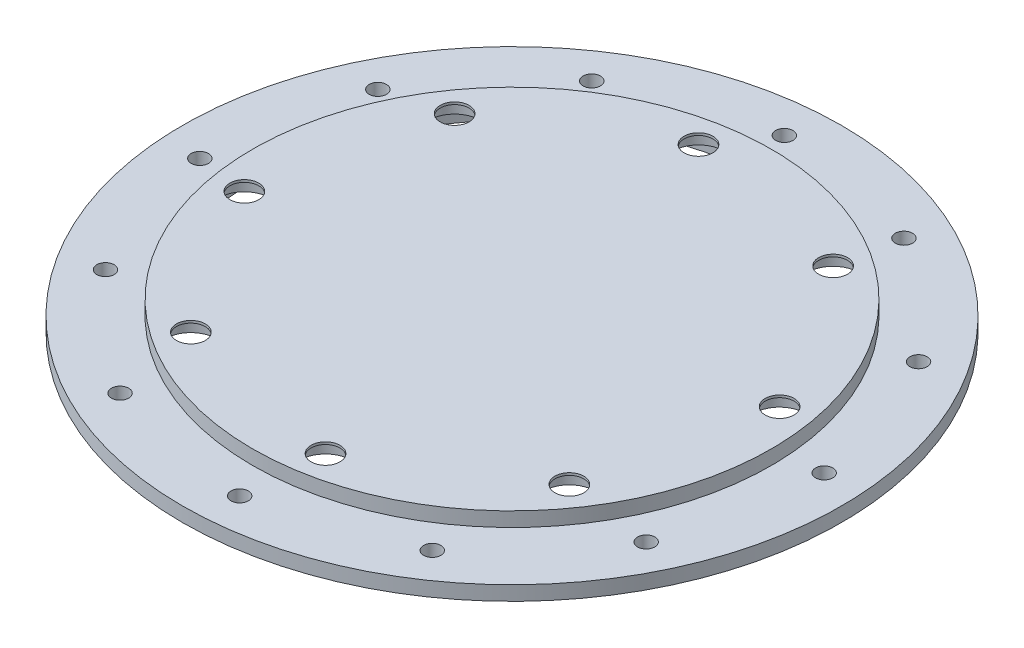
ISO-10303-21;
HEADER;
FILE_DESCRIPTION(('STEP AP214'),'2;1');
FILE_NAME('part.step','',(''),(''),'','','');
FILE_SCHEMA(('AUTOMOTIVE_DESIGN { 1 0 10303 214 1 1 1 1 }'));
ENDSEC;
DATA;
#1=APPLICATION_CONTEXT('core data for automotive mechanical design processes');
#2=APPLICATION_PROTOCOL_DEFINITION('international standard','automotive_design',2000,#1);
#3=PRODUCT_CONTEXT('',#1,'mechanical');
#4=PRODUCT('Part','Part','',(#3));
#5=PRODUCT_RELATED_PRODUCT_CATEGORY('part','',(#4));
#6=PRODUCT_DEFINITION_FORMATION('','',#4);
#7=PRODUCT_DEFINITION_CONTEXT('part definition',#1,'design');
#8=PRODUCT_DEFINITION('design','',#6,#7);
#9=PRODUCT_DEFINITION_SHAPE('','',#8);
#10=(LENGTH_UNIT() NAMED_UNIT(*) SI_UNIT(.MILLI.,.METRE.));
#11=(NAMED_UNIT(*) PLANE_ANGLE_UNIT() SI_UNIT($,.RADIAN.));
#12=(NAMED_UNIT(*) SI_UNIT($,.STERADIAN.) SOLID_ANGLE_UNIT());
#13=UNCERTAINTY_MEASURE_WITH_UNIT(LENGTH_MEASURE(1.E-05),#10,'distance_accuracy_value','');
#14=(GEOMETRIC_REPRESENTATION_CONTEXT(3) GLOBAL_UNCERTAINTY_ASSIGNED_CONTEXT((#13)) GLOBAL_UNIT_ASSIGNED_CONTEXT((#10,
#11,#12)) REPRESENTATION_CONTEXT('',''));
#15=CARTESIAN_POINT('',(0.,0.,0.));
#16=DIRECTION('',(0.,0.,1.));
#17=DIRECTION('',(1.,0.,0.));
#18=AXIS2_PLACEMENT_3D('',#15,#16,#17);
#19=CARTESIAN_POINT('',(0.,5.,0.));
#20=DIRECTION('',(0.,-1.,0.));
#21=DIRECTION('',(0.,0.,-1.));
#22=AXIS2_PLACEMENT_3D('',#19,#20,#21);
#23=CYLINDRICAL_SURFACE('',#22,114.3);
#24=CARTESIAN_POINT('',(0.,5.,0.));
#25=DIRECTION('',(0.,1.,0.));
#26=DIRECTION('',(0.,0.,1.));
#27=AXIS2_PLACEMENT_3D('',#24,#25,#26);
#28=CIRCLE('',#27,114.3);
#29=CARTESIAN_POINT('',(0.,5.,114.3));
#30=VERTEX_POINT('',#29);
#31=EDGE_CURVE('E49',#30,#30,#28,.T.);
#32=ORIENTED_EDGE('',*,*,#31,.F.);
#33=EDGE_LOOP('',(#32));
#34=FACE_BOUND('',#33,.T.);
#35=CARTESIAN_POINT('',(0.,0.,0.));
#36=DIRECTION('',(0.,1.,0.));
#37=DIRECTION('',(0.,0.,1.));
#38=AXIS2_PLACEMENT_3D('',#35,#36,#37);
#39=CIRCLE('',#38,114.3);
#40=CARTESIAN_POINT('',(0.,0.,114.3));
#41=VERTEX_POINT('',#40);
#42=EDGE_CURVE('E44',#41,#41,#39,.T.);
#43=ORIENTED_EDGE('',*,*,#42,.T.);
#44=EDGE_LOOP('',(#43));
#45=FACE_BOUND('',#44,.T.);
#46=ADVANCED_FACE('F41',(#34,#45),#23,.T.);
#47=CARTESIAN_POINT('',(0.,5.,0.));
#48=DIRECTION('',(0.,1.,0.));
#49=DIRECTION('',(0.,0.,1.));
#50=AXIS2_PLACEMENT_3D('',#47,#48,#49);
#51=PLANE('',#50);
#52=CARTESIAN_POINT('',(44.6970334047992,5.,-91.2399868742333));
#53=DIRECTION('',(0.,1.,0.));
#54=DIRECTION('',(0.,0.,1.));
#55=AXIS2_PLACEMENT_3D('',#52,#53,#54);
#56=CIRCLE('',#55,3.);
#57=CARTESIAN_POINT('',(44.6970334047992,5.,-88.2399868742333));
#58=VERTEX_POINT('',#57);
#59=EDGE_CURVE('E160',#58,#58,#56,.T.);
#60=ORIENTED_EDGE('',*,*,#59,.F.);
#61=EDGE_LOOP('',(#60));
#62=FACE_BOUND('',#61,.T.);
#63=CARTESIAN_POINT('',(84.3287598394745,5.,-56.6676297716451));
#64=DIRECTION('',(0.,1.,0.));
#65=DIRECTION('',(0.,0.,1.));
#66=AXIS2_PLACEMENT_3D('',#63,#64,#65);
#67=CIRCLE('',#66,3.);
#68=CARTESIAN_POINT('',(84.3287598394745,5.,-53.667629771645));
#69=VERTEX_POINT('',#68);
#70=EDGE_CURVE('E152',#69,#69,#67,.T.);
#71=ORIENTED_EDGE('',*,*,#70,.F.);
#72=EDGE_LOOP('',(#71));
#73=FACE_BOUND('',#72,.T.);
#74=CARTESIAN_POINT('',(101.364663176444,5.,-6.91122703475861));
#75=DIRECTION('',(0.,1.,0.));
#76=DIRECTION('',(0.,0.,1.));
#77=AXIS2_PLACEMENT_3D('',#74,#75,#76);
#78=CIRCLE('',#77,3.);
#79=CARTESIAN_POINT('',(101.364663176444,5.,-3.91122703475861));
#80=VERTEX_POINT('',#79);
#81=EDGE_CURVE('E144',#80,#80,#78,.T.);
#82=ORIENTED_EDGE('',*,*,#81,.F.);
#83=EDGE_LOOP('',(#82));
#84=FACE_BOUND('',#83,.T.);
#85=CARTESIAN_POINT('',(91.2399868742331,5.,44.6970334047995));
#86=DIRECTION('',(0.,1.,0.));
#87=DIRECTION('',(0.,0.,1.));
#88=AXIS2_PLACEMENT_3D('',#85,#86,#87);
#89=CIRCLE('',#88,3.);
#90=CARTESIAN_POINT('',(91.2399868742331,5.,47.6970334047995));
#91=VERTEX_POINT('',#90);
#92=EDGE_CURVE('E136',#91,#91,#89,.T.);
#93=ORIENTED_EDGE('',*,*,#92,.F.);
#94=EDGE_LOOP('',(#93));
#95=FACE_BOUND('',#94,.T.);
#96=CARTESIAN_POINT('',(56.6676297716448,5.,84.3287598394747));
#97=DIRECTION('',(0.,1.,0.));
#98=DIRECTION('',(0.,0.,1.));
#99=AXIS2_PLACEMENT_3D('',#96,#97,#98);
#100=CIRCLE('',#99,3.);
#101=CARTESIAN_POINT('',(56.6676297716448,5.,87.3287598394747));
#102=VERTEX_POINT('',#101);
#103=EDGE_CURVE('E128',#102,#102,#100,.T.);
#104=ORIENTED_EDGE('',*,*,#103,.F.);
#105=EDGE_LOOP('',(#104));
#106=FACE_BOUND('',#105,.T.);
#107=CARTESIAN_POINT('',(6.91122703475755,5.,101.364663176444));
#108=DIRECTION('',(0.,1.,0.));
#109=DIRECTION('',(0.,0.,1.));
#110=AXIS2_PLACEMENT_3D('',#107,#108,#109);
#111=CIRCLE('',#110,3.);
#112=CARTESIAN_POINT('',(6.91122703475755,5.,104.364663176444));
#113=VERTEX_POINT('',#112);
#114=EDGE_CURVE('E120',#113,#113,#111,.T.);
#115=ORIENTED_EDGE('',*,*,#114,.F.);
#116=EDGE_LOOP('',(#115));
#117=FACE_BOUND('',#116,.T.);
#118=CARTESIAN_POINT('',(-44.6970334047999,5.,91.239986874233));
#119=DIRECTION('',(0.,1.,0.));
#120=DIRECTION('',(0.,0.,1.));
#121=AXIS2_PLACEMENT_3D('',#118,#119,#120);
#122=CIRCLE('',#121,3.);
#123=CARTESIAN_POINT('',(-44.6970334047999,5.,94.239986874233));
#124=VERTEX_POINT('',#123);
#125=EDGE_CURVE('E112',#124,#124,#122,.T.);
#126=ORIENTED_EDGE('',*,*,#125,.F.);
#127=EDGE_LOOP('',(#126));
#128=FACE_BOUND('',#127,.T.);
#129=CARTESIAN_POINT('',(-84.3287598394749,5.,56.6676297716445));
#130=DIRECTION('',(0.,1.,0.));
#131=DIRECTION('',(0.,0.,1.));
#132=AXIS2_PLACEMENT_3D('',#129,#130,#131);
#133=CIRCLE('',#132,3.);
#134=CARTESIAN_POINT('',(-84.3287598394749,5.,59.6676297716445));
#135=VERTEX_POINT('',#134);
#136=EDGE_CURVE('E104',#135,#135,#133,.T.);
#137=ORIENTED_EDGE('',*,*,#136,.F.);
#138=EDGE_LOOP('',(#137));
#139=FACE_BOUND('',#138,.T.);
#140=CARTESIAN_POINT('',(-101.364663176444,5.,6.91122703475791));
#141=DIRECTION('',(0.,1.,0.));
#142=DIRECTION('',(0.,0.,1.));
#143=AXIS2_PLACEMENT_3D('',#140,#141,#142);
#144=CIRCLE('',#143,3.);
#145=CARTESIAN_POINT('',(-101.364663176444,5.,9.91122703475791));
#146=VERTEX_POINT('',#145);
#147=EDGE_CURVE('E96',#146,#146,#144,.T.);
#148=ORIENTED_EDGE('',*,*,#147,.F.);
#149=EDGE_LOOP('',(#148));
#150=FACE_BOUND('',#149,.T.);
#151=CARTESIAN_POINT('',(-91.2399868742328,5.,-44.6970334048002));
#152=DIRECTION('',(0.,1.,0.));
#153=DIRECTION('',(0.,0.,1.));
#154=AXIS2_PLACEMENT_3D('',#151,#152,#153);
#155=CIRCLE('',#154,3.);
#156=CARTESIAN_POINT('',(-91.2399868742328,5.,-41.6970334048002));
#157=VERTEX_POINT('',#156);
#158=EDGE_CURVE('E88',#157,#157,#155,.T.);
#159=ORIENTED_EDGE('',*,*,#158,.F.);
#160=EDGE_LOOP('',(#159));
#161=FACE_BOUND('',#160,.T.);
#162=CARTESIAN_POINT('',(-56.6676297716442,5.,-84.3287598394751));
#163=DIRECTION('',(0.,1.,0.));
#164=DIRECTION('',(0.,0.,1.));
#165=AXIS2_PLACEMENT_3D('',#162,#163,#164);
#166=CIRCLE('',#165,3.);
#167=CARTESIAN_POINT('',(-56.6676297716442,5.,-81.3287598394751));
#168=VERTEX_POINT('',#167);
#169=EDGE_CURVE('E80',#168,#168,#166,.T.);
#170=ORIENTED_EDGE('',*,*,#169,.F.);
#171=EDGE_LOOP('',(#170));
#172=FACE_BOUND('',#171,.T.);
#173=CARTESIAN_POINT('',(-6.91122703475755,5.,-101.364663176444));
#174=DIRECTION('',(0.,1.,0.));
#175=DIRECTION('',(0.,0.,1.));
#176=AXIS2_PLACEMENT_3D('',#173,#174,#175);
#177=CIRCLE('',#176,3.);
#178=CARTESIAN_POINT('',(-6.91122703475755,5.,-98.3646631764445));
#179=VERTEX_POINT('',#178);
#180=EDGE_CURVE('E72',#179,#179,#177,.T.);
#181=ORIENTED_EDGE('',*,*,#180,.F.);
#182=EDGE_LOOP('',(#181));
#183=FACE_BOUND('',#182,.T.);
#184=CARTESIAN_POINT('',(0.,5.,0.));
#185=DIRECTION('',(0.,1.,0.));
#186=DIRECTION('',(0.,0.,1.));
#187=AXIS2_PLACEMENT_3D('',#184,#185,#186);
#188=CIRCLE('',#187,90.);
#189=CARTESIAN_POINT('',(0.,5.,90.));
#190=VERTEX_POINT('',#189);
#191=EDGE_CURVE('E10',#190,#190,#188,.T.);
#192=ORIENTED_EDGE('',*,*,#191,.F.);
#193=EDGE_LOOP('',(#192));
#194=FACE_BOUND('',#193,.T.);
#195=ORIENTED_EDGE('',*,*,#31,.T.);
#196=EDGE_LOOP('',(#195));
#197=FACE_BOUND('',#196,.T.);
#198=ADVANCED_FACE('F327',(#62,#73,#84,#95,#106,#117,#128,#139,#150,#161,#172,#183,#194,#197),
#51,.T.);
#199=CARTESIAN_POINT('',(0.,0.,0.));
#200=DIRECTION('',(0.,1.,0.));
#201=DIRECTION('',(0.,0.,1.));
#202=AXIS2_PLACEMENT_3D('',#199,#200,#201);
#203=PLANE('',#202);
#204=CARTESIAN_POINT('',(44.6970334047992,0.,-91.2399868742333));
#205=DIRECTION('',(0.,1.,0.));
#206=DIRECTION('',(0.,0.,1.));
#207=AXIS2_PLACEMENT_3D('',#204,#205,#206);
#208=CIRCLE('',#207,3.);
#209=CARTESIAN_POINT('',(44.6970334047992,0.,-88.2399868742333));
#210=VERTEX_POINT('',#209);
#211=EDGE_CURVE('E156',#210,#210,#208,.T.);
#212=ORIENTED_EDGE('',*,*,#211,.T.);
#213=EDGE_LOOP('',(#212));
#214=FACE_BOUND('',#213,.T.);
#215=CARTESIAN_POINT('',(84.3287598394745,0.,-56.6676297716451));
#216=DIRECTION('',(0.,1.,0.));
#217=DIRECTION('',(0.,0.,1.));
#218=AXIS2_PLACEMENT_3D('',#215,#216,#217);
#219=CIRCLE('',#218,3.);
#220=CARTESIAN_POINT('',(84.3287598394745,0.,-53.667629771645));
#221=VERTEX_POINT('',#220);
#222=EDGE_CURVE('E148',#221,#221,#219,.T.);
#223=ORIENTED_EDGE('',*,*,#222,.T.);
#224=EDGE_LOOP('',(#223));
#225=FACE_BOUND('',#224,.T.);
#226=CARTESIAN_POINT('',(101.364663176444,0.,-6.91122703475861));
#227=DIRECTION('',(0.,1.,0.));
#228=DIRECTION('',(0.,0.,1.));
#229=AXIS2_PLACEMENT_3D('',#226,#227,#228);
#230=CIRCLE('',#229,3.);
#231=CARTESIAN_POINT('',(101.364663176444,0.,-3.91122703475861));
#232=VERTEX_POINT('',#231);
#233=EDGE_CURVE('E140',#232,#232,#230,.T.);
#234=ORIENTED_EDGE('',*,*,#233,.T.);
#235=EDGE_LOOP('',(#234));
#236=FACE_BOUND('',#235,.T.);
#237=CARTESIAN_POINT('',(91.2399868742331,0.,44.6970334047995));
#238=DIRECTION('',(0.,1.,0.));
#239=DIRECTION('',(0.,0.,1.));
#240=AXIS2_PLACEMENT_3D('',#237,#238,#239);
#241=CIRCLE('',#240,3.);
#242=CARTESIAN_POINT('',(91.2399868742331,0.,47.6970334047995));
#243=VERTEX_POINT('',#242);
#244=EDGE_CURVE('E132',#243,#243,#241,.T.);
#245=ORIENTED_EDGE('',*,*,#244,.T.);
#246=EDGE_LOOP('',(#245));
#247=FACE_BOUND('',#246,.T.);
#248=CARTESIAN_POINT('',(56.6676297716448,0.,84.3287598394747));
#249=DIRECTION('',(0.,1.,0.));
#250=DIRECTION('',(0.,0.,1.));
#251=AXIS2_PLACEMENT_3D('',#248,#249,#250);
#252=CIRCLE('',#251,3.);
#253=CARTESIAN_POINT('',(56.6676297716448,0.,87.3287598394747));
#254=VERTEX_POINT('',#253);
#255=EDGE_CURVE('E124',#254,#254,#252,.T.);
#256=ORIENTED_EDGE('',*,*,#255,.T.);
#257=EDGE_LOOP('',(#256));
#258=FACE_BOUND('',#257,.T.);
#259=CARTESIAN_POINT('',(6.91122703475755,0.,101.364663176444));
#260=DIRECTION('',(0.,1.,0.));
#261=DIRECTION('',(0.,0.,1.));
#262=AXIS2_PLACEMENT_3D('',#259,#260,#261);
#263=CIRCLE('',#262,3.);
#264=CARTESIAN_POINT('',(6.91122703475755,0.,104.364663176444));
#265=VERTEX_POINT('',#264);
#266=EDGE_CURVE('E116',#265,#265,#263,.T.);
#267=ORIENTED_EDGE('',*,*,#266,.T.);
#268=EDGE_LOOP('',(#267));
#269=FACE_BOUND('',#268,.T.);
#270=CARTESIAN_POINT('',(-44.6970334047999,0.,91.239986874233));
#271=DIRECTION('',(0.,1.,0.));
#272=DIRECTION('',(0.,0.,1.));
#273=AXIS2_PLACEMENT_3D('',#270,#271,#272);
#274=CIRCLE('',#273,3.);
#275=CARTESIAN_POINT('',(-44.6970334047999,0.,94.239986874233));
#276=VERTEX_POINT('',#275);
#277=EDGE_CURVE('E108',#276,#276,#274,.T.);
#278=ORIENTED_EDGE('',*,*,#277,.T.);
#279=EDGE_LOOP('',(#278));
#280=FACE_BOUND('',#279,.T.);
#281=CARTESIAN_POINT('',(-84.3287598394749,0.,56.6676297716445));
#282=DIRECTION('',(0.,1.,0.));
#283=DIRECTION('',(0.,0.,1.));
#284=AXIS2_PLACEMENT_3D('',#281,#282,#283);
#285=CIRCLE('',#284,3.);
#286=CARTESIAN_POINT('',(-84.3287598394749,0.,59.6676297716445));
#287=VERTEX_POINT('',#286);
#288=EDGE_CURVE('E100',#287,#287,#285,.T.);
#289=ORIENTED_EDGE('',*,*,#288,.T.);
#290=EDGE_LOOP('',(#289));
#291=FACE_BOUND('',#290,.T.);
#292=CARTESIAN_POINT('',(-101.364663176444,0.,6.91122703475791));
#293=DIRECTION('',(0.,1.,0.));
#294=DIRECTION('',(0.,0.,1.));
#295=AXIS2_PLACEMENT_3D('',#292,#293,#294);
#296=CIRCLE('',#295,3.);
#297=CARTESIAN_POINT('',(-101.364663176444,0.,9.91122703475791));
#298=VERTEX_POINT('',#297);
#299=EDGE_CURVE('E92',#298,#298,#296,.T.);
#300=ORIENTED_EDGE('',*,*,#299,.T.);
#301=EDGE_LOOP('',(#300));
#302=FACE_BOUND('',#301,.T.);
#303=CARTESIAN_POINT('',(-91.2399868742328,0.,-44.6970334048002));
#304=DIRECTION('',(0.,1.,0.));
#305=DIRECTION('',(0.,0.,1.));
#306=AXIS2_PLACEMENT_3D('',#303,#304,#305);
#307=CIRCLE('',#306,3.);
#308=CARTESIAN_POINT('',(-91.2399868742328,0.,-41.6970334048002));
#309=VERTEX_POINT('',#308);
#310=EDGE_CURVE('E84',#309,#309,#307,.T.);
#311=ORIENTED_EDGE('',*,*,#310,.T.);
#312=EDGE_LOOP('',(#311));
#313=FACE_BOUND('',#312,.T.);
#314=CARTESIAN_POINT('',(-56.6676297716442,0.,-84.3287598394751));
#315=DIRECTION('',(0.,1.,0.));
#316=DIRECTION('',(0.,0.,1.));
#317=AXIS2_PLACEMENT_3D('',#314,#315,#316);
#318=CIRCLE('',#317,3.);
#319=CARTESIAN_POINT('',(-56.6676297716442,0.,-81.3287598394751));
#320=VERTEX_POINT('',#319);
#321=EDGE_CURVE('E76',#320,#320,#318,.T.);
#322=ORIENTED_EDGE('',*,*,#321,.T.);
#323=EDGE_LOOP('',(#322));
#324=FACE_BOUND('',#323,.T.);
#325=CARTESIAN_POINT('',(-6.91122703475755,0.,-101.364663176444));
#326=DIRECTION('',(0.,1.,0.));
#327=DIRECTION('',(0.,0.,1.));
#328=AXIS2_PLACEMENT_3D('',#325,#326,#327);
#329=CIRCLE('',#328,3.);
#330=CARTESIAN_POINT('',(-6.91122703475755,0.,-98.3646631764445));
#331=VERTEX_POINT('',#330);
#332=EDGE_CURVE('E65',#331,#331,#329,.T.);
#333=ORIENTED_EDGE('',*,*,#332,.T.);
#334=EDGE_LOOP('',(#333));
#335=FACE_BOUND('',#334,.T.);
#336=CARTESIAN_POINT('',(0.,0.,0.));
#337=DIRECTION('',(0.,-1.,0.));
#338=DIRECTION('',(0.,0.,-1.));
#339=AXIS2_PLACEMENT_3D('',#336,#337,#338);
#340=CIRCLE('',#339,90.);
#341=CARTESIAN_POINT('',(0.,0.,-90.));
#342=VERTEX_POINT('',#341);
#343=EDGE_CURVE('E61',#342,#342,#340,.T.);
#344=ORIENTED_EDGE('',*,*,#343,.F.);
#345=EDGE_LOOP('',(#344));
#346=FACE_BOUND('',#345,.T.);
#347=ORIENTED_EDGE('',*,*,#42,.F.);
#348=EDGE_LOOP('',(#347));
#349=FACE_BOUND('',#348,.T.);
#350=ADVANCED_FACE('F323',(#214,#225,#236,#247,#258,#269,#280,#291,#302,#313,#324,#335,#346,
#349),#203,.F.);
#351=CARTESIAN_POINT('',(0.,10.,0.));
#352=DIRECTION('',(0.,-1.,0.));
#353=DIRECTION('',(0.,0.,-1.));
#354=AXIS2_PLACEMENT_3D('',#351,#352,#353);
#355=CYLINDRICAL_SURFACE('',#354,90.);
#356=CARTESIAN_POINT('',(0.,10.,0.));
#357=DIRECTION('',(0.,1.,0.));
#358=DIRECTION('',(0.,0.,1.));
#359=AXIS2_PLACEMENT_3D('',#356,#357,#358);
#360=CIRCLE('',#359,90.);
#361=CARTESIAN_POINT('',(0.,10.,90.));
#362=VERTEX_POINT('',#361);
#363=EDGE_CURVE('E56',#362,#362,#360,.T.);
#364=ORIENTED_EDGE('',*,*,#363,.F.);
#365=EDGE_LOOP('',(#364));
#366=FACE_BOUND('',#365,.T.);
#367=ORIENTED_EDGE('',*,*,#191,.T.);
#368=EDGE_LOOP('',(#367));
#369=FACE_BOUND('',#368,.T.);
#370=ADVANCED_FACE('F326',(#366,#369),#355,.T.);
#371=CARTESIAN_POINT('',(0.,10.,0.));
#372=DIRECTION('',(0.,1.,0.));
#373=DIRECTION('',(0.,0.,1.));
#374=AXIS2_PLACEMENT_3D('',#371,#372,#373);
#375=PLANE('',#374);
#376=CARTESIAN_POINT('',(-14.0736147160154,10.,-78.7523546874958));
#377=DIRECTION('',(0.,1.,0.));
#378=DIRECTION('',(0.,0.,1.));
#379=AXIS2_PLACEMENT_3D('',#376,#377,#378);
#380=CIRCLE('',#379,5.);
#381=CARTESIAN_POINT('',(-14.0736147160154,10.,-73.7523546874958));
#382=VERTEX_POINT('',#381);
#383=EDGE_CURVE('E276',#382,#382,#380,.T.);
#384=ORIENTED_EDGE('',*,*,#383,.F.);
#385=EDGE_LOOP('',(#384));
#386=FACE_BOUND('',#385,.T.);
#387=CARTESIAN_POINT('',(-65.6378724354379,10.,-45.7347756324351));
#388=DIRECTION('',(0.,1.,0.));
#389=DIRECTION('',(0.,0.,1.));
#390=AXIS2_PLACEMENT_3D('',#387,#388,#389);
#391=CIRCLE('',#390,5.);
#392=CARTESIAN_POINT('',(-65.6378724354379,10.,-40.7347756324351));
#393=VERTEX_POINT('',#392);
#394=EDGE_CURVE('E260',#393,#393,#391,.T.);
#395=ORIENTED_EDGE('',*,*,#394,.F.);
#396=EDGE_LOOP('',(#395));
#397=FACE_BOUND('',#396,.T.);
#398=CARTESIAN_POINT('',(-78.7523546874958,10.,14.0736147160157));
#399=DIRECTION('',(0.,1.,0.));
#400=DIRECTION('',(0.,0.,1.));
#401=AXIS2_PLACEMENT_3D('',#398,#399,#400);
#402=CIRCLE('',#401,5.);
#403=CARTESIAN_POINT('',(-78.7523546874958,10.,19.0736147160157));
#404=VERTEX_POINT('',#403);
#405=EDGE_CURVE('E244',#404,#404,#402,.T.);
#406=ORIENTED_EDGE('',*,*,#405,.F.);
#407=EDGE_LOOP('',(#406));
#408=FACE_BOUND('',#407,.T.);
#409=CARTESIAN_POINT('',(-45.7347756324344,10.,65.6378724354383));
#410=DIRECTION('',(0.,1.,0.));
#411=DIRECTION('',(0.,0.,1.));
#412=AXIS2_PLACEMENT_3D('',#409,#410,#411);
#413=CIRCLE('',#412,5.);
#414=CARTESIAN_POINT('',(-45.7347756324344,10.,70.6378724354383));
#415=VERTEX_POINT('',#414);
#416=EDGE_CURVE('E228',#415,#415,#413,.T.);
#417=ORIENTED_EDGE('',*,*,#416,.F.);
#418=EDGE_LOOP('',(#417));
#419=FACE_BOUND('',#418,.T.);
#420=CARTESIAN_POINT('',(14.0736147160159,10.,78.7523546874958));
#421=DIRECTION('',(0.,1.,0.));
#422=DIRECTION('',(0.,0.,1.));
#423=AXIS2_PLACEMENT_3D('',#420,#421,#422);
#424=CIRCLE('',#423,5.);
#425=CARTESIAN_POINT('',(14.0736147160159,10.,83.7523546874958));
#426=VERTEX_POINT('',#425);
#427=EDGE_CURVE('E212',#426,#426,#424,.T.);
#428=ORIENTED_EDGE('',*,*,#427,.F.);
#429=EDGE_LOOP('',(#428));
#430=FACE_BOUND('',#429,.T.);
#431=CARTESIAN_POINT('',(65.6378724354382,10.,45.7347756324347));
#432=DIRECTION('',(0.,1.,0.));
#433=DIRECTION('',(0.,0.,1.));
#434=AXIS2_PLACEMENT_3D('',#431,#432,#433);
#435=CIRCLE('',#434,5.);
#436=CARTESIAN_POINT('',(65.6378724354382,10.,50.7347756324347));
#437=VERTEX_POINT('',#436);
#438=EDGE_CURVE('E196',#437,#437,#435,.T.);
#439=ORIENTED_EDGE('',*,*,#438,.F.);
#440=EDGE_LOOP('',(#439));
#441=FACE_BOUND('',#440,.T.);
#442=CARTESIAN_POINT('',(78.7523546874957,10.,-14.0736147160162));
#443=DIRECTION('',(0.,1.,0.));
#444=DIRECTION('',(0.,0.,1.));
#445=AXIS2_PLACEMENT_3D('',#442,#443,#444);
#446=CIRCLE('',#445,5.);
#447=CARTESIAN_POINT('',(78.7523546874957,10.,-9.07361471601622));
#448=VERTEX_POINT('',#447);
#449=EDGE_CURVE('E180',#448,#448,#446,.T.);
#450=ORIENTED_EDGE('',*,*,#449,.F.);
#451=EDGE_LOOP('',(#450));
#452=FACE_BOUND('',#451,.T.);
#453=CARTESIAN_POINT('',(45.7347756324344,10.,-65.6378724354383));
#454=DIRECTION('',(0.,1.,0.));
#455=DIRECTION('',(0.,0.,1.));
#456=AXIS2_PLACEMENT_3D('',#453,#454,#455);
#457=CIRCLE('',#456,5.);
#458=CARTESIAN_POINT('',(45.7347756324344,10.,-60.6378724354383));
#459=VERTEX_POINT('',#458);
#460=EDGE_CURVE('E164',#459,#459,#457,.T.);
#461=ORIENTED_EDGE('',*,*,#460,.F.);
#462=EDGE_LOOP('',(#461));
#463=FACE_BOUND('',#462,.T.);
#464=ORIENTED_EDGE('',*,*,#363,.T.);
#465=EDGE_LOOP('',(#464));
#466=FACE_BOUND('',#465,.T.);
#467=ADVANCED_FACE('F319',(#386,#397,#408,#419,#430,#441,#452,#463,#466),#375,.T.);
#468=CARTESIAN_POINT('',(0.,3.5,0.));
#469=DIRECTION('',(0.,-1.,0.));
#470=DIRECTION('',(0.,0.,-1.));
#471=AXIS2_PLACEMENT_3D('',#468,#469,#470);
#472=CYLINDRICAL_SURFACE('',#471,90.);
#473=CARTESIAN_POINT('',(0.,3.5,0.));
#474=DIRECTION('',(0.,-1.,0.));
#475=DIRECTION('',(0.,0.,-1.));
#476=AXIS2_PLACEMENT_3D('',#473,#474,#475);
#477=CIRCLE('',#476,90.);
#478=CARTESIAN_POINT('',(0.,3.5,-90.));
#479=VERTEX_POINT('',#478);
#480=EDGE_CURVE('E60',#479,#479,#477,.T.);
#481=ORIENTED_EDGE('',*,*,#480,.F.);
#482=EDGE_LOOP('',(#481));
#483=FACE_BOUND('',#482,.T.);
#484=ORIENTED_EDGE('',*,*,#343,.T.);
#485=EDGE_LOOP('',(#484));
#486=FACE_BOUND('',#485,.T.);
#487=ADVANCED_FACE('F299',(#483,#486),#472,.F.);
#488=CARTESIAN_POINT('',(0.,3.5,0.));
#489=DIRECTION('',(0.,-1.,0.));
#490=DIRECTION('',(0.,0.,-1.));
#491=AXIS2_PLACEMENT_3D('',#488,#489,#490);
#492=PLANE('',#491);
#493=CARTESIAN_POINT('',(-14.0736147160154,3.5,-78.7523546874958));
#494=DIRECTION('',(0.,-1.,0.));
#495=DIRECTION('',(0.,0.,-1.));
#496=AXIS2_PLACEMENT_3D('',#493,#494,#495);
#497=CIRCLE('',#496,9.005);
#498=CARTESIAN_POINT('',(-14.0736147160154,3.5,-87.7573546874958));
#499=VERTEX_POINT('',#498);
#500=EDGE_CURVE('E288',#499,#499,#497,.T.);
#501=ORIENTED_EDGE('',*,*,#500,.F.);
#502=EDGE_LOOP('',(#501));
#503=FACE_BOUND('',#502,.T.);
#504=CARTESIAN_POINT('',(-65.6378724354379,3.5,-45.7347756324351));
#505=DIRECTION('',(0.,-1.,0.));
#506=DIRECTION('',(0.,0.,-1.));
#507=AXIS2_PLACEMENT_3D('',#504,#505,#506);
#508=CIRCLE('',#507,9.005);
#509=CARTESIAN_POINT('',(-65.6378724354379,3.5,-54.7397756324351));
#510=VERTEX_POINT('',#509);
#511=EDGE_CURVE('E272',#510,#510,#508,.T.);
#512=ORIENTED_EDGE('',*,*,#511,.F.);
#513=EDGE_LOOP('',(#512));
#514=FACE_BOUND('',#513,.T.);
#515=CARTESIAN_POINT('',(-78.7523546874958,3.5,14.0736147160157));
#516=DIRECTION('',(0.,-1.,0.));
#517=DIRECTION('',(0.,0.,-1.));
#518=AXIS2_PLACEMENT_3D('',#515,#516,#517);
#519=CIRCLE('',#518,9.005);
#520=CARTESIAN_POINT('',(-78.7523546874958,3.5,5.06861471601567));
#521=VERTEX_POINT('',#520);
#522=EDGE_CURVE('E256',#521,#521,#519,.T.);
#523=ORIENTED_EDGE('',*,*,#522,.F.);
#524=EDGE_LOOP('',(#523));
#525=FACE_BOUND('',#524,.T.);
#526=CARTESIAN_POINT('',(-45.7347756324344,3.5,65.6378724354383));
#527=DIRECTION('',(0.,-1.,0.));
#528=DIRECTION('',(0.,0.,-1.));
#529=AXIS2_PLACEMENT_3D('',#526,#527,#528);
#530=CIRCLE('',#529,9.005);
#531=CARTESIAN_POINT('',(-45.7347756324344,3.5,56.6328724354383));
#532=VERTEX_POINT('',#531);
#533=EDGE_CURVE('E240',#532,#532,#530,.T.);
#534=ORIENTED_EDGE('',*,*,#533,.F.);
#535=EDGE_LOOP('',(#534));
#536=FACE_BOUND('',#535,.T.);
#537=CARTESIAN_POINT('',(14.0736147160159,3.5,78.7523546874958));
#538=DIRECTION('',(0.,-1.,0.));
#539=DIRECTION('',(0.,0.,-1.));
#540=AXIS2_PLACEMENT_3D('',#537,#538,#539);
#541=CIRCLE('',#540,9.005);
#542=CARTESIAN_POINT('',(14.0736147160159,3.5,69.7473546874958));
#543=VERTEX_POINT('',#542);
#544=EDGE_CURVE('E224',#543,#543,#541,.T.);
#545=ORIENTED_EDGE('',*,*,#544,.F.);
#546=EDGE_LOOP('',(#545));
#547=FACE_BOUND('',#546,.T.);
#548=CARTESIAN_POINT('',(65.6378724354382,3.5,45.7347756324347));
#549=DIRECTION('',(0.,-1.,0.));
#550=DIRECTION('',(0.,0.,-1.));
#551=AXIS2_PLACEMENT_3D('',#548,#549,#550);
#552=CIRCLE('',#551,9.005);
#553=CARTESIAN_POINT('',(65.6378724354382,3.5,36.7297756324347));
#554=VERTEX_POINT('',#553);
#555=EDGE_CURVE('E208',#554,#554,#552,.T.);
#556=ORIENTED_EDGE('',*,*,#555,.F.);
#557=EDGE_LOOP('',(#556));
#558=FACE_BOUND('',#557,.T.);
#559=CARTESIAN_POINT('',(78.7523546874957,3.5,-14.0736147160162));
#560=DIRECTION('',(0.,-1.,0.));
#561=DIRECTION('',(0.,0.,-1.));
#562=AXIS2_PLACEMENT_3D('',#559,#560,#561);
#563=CIRCLE('',#562,9.005);
#564=CARTESIAN_POINT('',(78.7523546874957,3.5,-23.0786147160162));
#565=VERTEX_POINT('',#564);
#566=EDGE_CURVE('E192',#565,#565,#563,.T.);
#567=ORIENTED_EDGE('',*,*,#566,.F.);
#568=EDGE_LOOP('',(#567));
#569=FACE_BOUND('',#568,.T.);
#570=CARTESIAN_POINT('',(45.7347756324344,3.5,-65.6378724354383));
#571=DIRECTION('',(0.,-1.,0.));
#572=DIRECTION('',(0.,0.,-1.));
#573=AXIS2_PLACEMENT_3D('',#570,#571,#572);
#574=CIRCLE('',#573,9.005);
#575=CARTESIAN_POINT('',(45.7347756324344,3.5,-74.6428724354383));
#576=VERTEX_POINT('',#575);
#577=EDGE_CURVE('E176',#576,#576,#574,.T.);
#578=ORIENTED_EDGE('',*,*,#577,.F.);
#579=EDGE_LOOP('',(#578));
#580=FACE_BOUND('',#579,.T.);
#581=ORIENTED_EDGE('',*,*,#480,.T.);
#582=EDGE_LOOP('',(#581));
#583=FACE_BOUND('',#582,.T.);
#584=ADVANCED_FACE('F295',(#503,#514,#525,#536,#547,#558,#569,#580,#583),#492,.T.);
#585=CARTESIAN_POINT('',(-6.91122703475755,5.,-101.364663176444));
#586=DIRECTION('',(0.,1.,0.));
#587=DIRECTION('',(0.,0.,1.));
#588=AXIS2_PLACEMENT_3D('',#585,#586,#587);
#589=CYLINDRICAL_SURFACE('',#588,3.);
#590=ORIENTED_EDGE('',*,*,#332,.F.);
#591=EDGE_LOOP('',(#590));
#592=FACE_BOUND('',#591,.T.);
#593=ORIENTED_EDGE('',*,*,#180,.T.);
#594=EDGE_LOOP('',(#593));
#595=FACE_BOUND('',#594,.T.);
#596=ADVANCED_FACE('F298',(#592,#595),#589,.F.);
#597=CARTESIAN_POINT('',(-56.6676297716442,5.,-84.3287598394751));
#598=DIRECTION('',(0.,1.,0.));
#599=DIRECTION('',(0.,0.,1.));
#600=AXIS2_PLACEMENT_3D('',#597,#598,#599);
#601=CYLINDRICAL_SURFACE('',#600,3.);
#602=ORIENTED_EDGE('',*,*,#321,.F.);
#603=EDGE_LOOP('',(#602));
#604=FACE_BOUND('',#603,.T.);
#605=ORIENTED_EDGE('',*,*,#169,.T.);
#606=EDGE_LOOP('',(#605));
#607=FACE_BOUND('',#606,.T.);
#608=ADVANCED_FACE('F355',(#604,#607),#601,.F.);
#609=CARTESIAN_POINT('',(-91.2399868742328,5.,-44.6970334048002));
#610=DIRECTION('',(0.,1.,0.));
#611=DIRECTION('',(0.,0.,1.));
#612=AXIS2_PLACEMENT_3D('',#609,#610,#611);
#613=CYLINDRICAL_SURFACE('',#612,3.);
#614=ORIENTED_EDGE('',*,*,#310,.F.);
#615=EDGE_LOOP('',(#614));
#616=FACE_BOUND('',#615,.T.);
#617=ORIENTED_EDGE('',*,*,#158,.T.);
#618=EDGE_LOOP('',(#617));
#619=FACE_BOUND('',#618,.T.);
#620=ADVANCED_FACE('F359',(#616,#619),#613,.F.);
#621=CARTESIAN_POINT('',(-101.364663176444,5.,6.91122703475791));
#622=DIRECTION('',(0.,1.,0.));
#623=DIRECTION('',(0.,0.,1.));
#624=AXIS2_PLACEMENT_3D('',#621,#622,#623);
#625=CYLINDRICAL_SURFACE('',#624,3.);
#626=ORIENTED_EDGE('',*,*,#299,.F.);
#627=EDGE_LOOP('',(#626));
#628=FACE_BOUND('',#627,.T.);
#629=ORIENTED_EDGE('',*,*,#147,.T.);
#630=EDGE_LOOP('',(#629));
#631=FACE_BOUND('',#630,.T.);
#632=ADVANCED_FACE('F363',(#628,#631),#625,.F.);
#633=CARTESIAN_POINT('',(-84.3287598394749,5.,56.6676297716445));
#634=DIRECTION('',(0.,1.,0.));
#635=DIRECTION('',(0.,0.,1.));
#636=AXIS2_PLACEMENT_3D('',#633,#634,#635);
#637=CYLINDRICAL_SURFACE('',#636,3.);
#638=ORIENTED_EDGE('',*,*,#288,.F.);
#639=EDGE_LOOP('',(#638));
#640=FACE_BOUND('',#639,.T.);
#641=ORIENTED_EDGE('',*,*,#136,.T.);
#642=EDGE_LOOP('',(#641));
#643=FACE_BOUND('',#642,.T.);
#644=ADVANCED_FACE('F367',(#640,#643),#637,.F.);
#645=CARTESIAN_POINT('',(-44.6970334047999,5.,91.239986874233));
#646=DIRECTION('',(0.,1.,0.));
#647=DIRECTION('',(0.,0.,1.));
#648=AXIS2_PLACEMENT_3D('',#645,#646,#647);
#649=CYLINDRICAL_SURFACE('',#648,3.);
#650=ORIENTED_EDGE('',*,*,#277,.F.);
#651=EDGE_LOOP('',(#650));
#652=FACE_BOUND('',#651,.T.);
#653=ORIENTED_EDGE('',*,*,#125,.T.);
#654=EDGE_LOOP('',(#653));
#655=FACE_BOUND('',#654,.T.);
#656=ADVANCED_FACE('F371',(#652,#655),#649,.F.);
#657=CARTESIAN_POINT('',(6.91122703475755,5.,101.364663176444));
#658=DIRECTION('',(0.,1.,0.));
#659=DIRECTION('',(0.,0.,1.));
#660=AXIS2_PLACEMENT_3D('',#657,#658,#659);
#661=CYLINDRICAL_SURFACE('',#660,3.);
#662=ORIENTED_EDGE('',*,*,#266,.F.);
#663=EDGE_LOOP('',(#662));
#664=FACE_BOUND('',#663,.T.);
#665=ORIENTED_EDGE('',*,*,#114,.T.);
#666=EDGE_LOOP('',(#665));
#667=FACE_BOUND('',#666,.T.);
#668=ADVANCED_FACE('F375',(#664,#667),#661,.F.);
#669=CARTESIAN_POINT('',(56.6676297716448,5.,84.3287598394747));
#670=DIRECTION('',(0.,1.,0.));
#671=DIRECTION('',(0.,0.,1.));
#672=AXIS2_PLACEMENT_3D('',#669,#670,#671);
#673=CYLINDRICAL_SURFACE('',#672,3.);
#674=ORIENTED_EDGE('',*,*,#255,.F.);
#675=EDGE_LOOP('',(#674));
#676=FACE_BOUND('',#675,.T.);
#677=ORIENTED_EDGE('',*,*,#103,.T.);
#678=EDGE_LOOP('',(#677));
#679=FACE_BOUND('',#678,.T.);
#680=ADVANCED_FACE('F379',(#676,#679),#673,.F.);
#681=CARTESIAN_POINT('',(91.2399868742331,5.,44.6970334047995));
#682=DIRECTION('',(0.,1.,0.));
#683=DIRECTION('',(0.,0.,1.));
#684=AXIS2_PLACEMENT_3D('',#681,#682,#683);
#685=CYLINDRICAL_SURFACE('',#684,3.);
#686=ORIENTED_EDGE('',*,*,#244,.F.);
#687=EDGE_LOOP('',(#686));
#688=FACE_BOUND('',#687,.T.);
#689=ORIENTED_EDGE('',*,*,#92,.T.);
#690=EDGE_LOOP('',(#689));
#691=FACE_BOUND('',#690,.T.);
#692=ADVANCED_FACE('F383',(#688,#691),#685,.F.);
#693=CARTESIAN_POINT('',(101.364663176444,5.,-6.91122703475861));
#694=DIRECTION('',(0.,1.,0.));
#695=DIRECTION('',(0.,0.,1.));
#696=AXIS2_PLACEMENT_3D('',#693,#694,#695);
#697=CYLINDRICAL_SURFACE('',#696,3.);
#698=ORIENTED_EDGE('',*,*,#233,.F.);
#699=EDGE_LOOP('',(#698));
#700=FACE_BOUND('',#699,.T.);
#701=ORIENTED_EDGE('',*,*,#81,.T.);
#702=EDGE_LOOP('',(#701));
#703=FACE_BOUND('',#702,.T.);
#704=ADVANCED_FACE('F387',(#700,#703),#697,.F.);
#705=CARTESIAN_POINT('',(84.3287598394745,5.,-56.6676297716451));
#706=DIRECTION('',(0.,1.,0.));
#707=DIRECTION('',(0.,0.,1.));
#708=AXIS2_PLACEMENT_3D('',#705,#706,#707);
#709=CYLINDRICAL_SURFACE('',#708,3.);
#710=ORIENTED_EDGE('',*,*,#222,.F.);
#711=EDGE_LOOP('',(#710));
#712=FACE_BOUND('',#711,.T.);
#713=ORIENTED_EDGE('',*,*,#70,.T.);
#714=EDGE_LOOP('',(#713));
#715=FACE_BOUND('',#714,.T.);
#716=ADVANCED_FACE('F391',(#712,#715),#709,.F.);
#717=CARTESIAN_POINT('',(44.6970334047992,5.,-91.2399868742333));
#718=DIRECTION('',(0.,1.,0.));
#719=DIRECTION('',(0.,0.,1.));
#720=AXIS2_PLACEMENT_3D('',#717,#718,#719);
#721=CYLINDRICAL_SURFACE('',#720,3.);
#722=ORIENTED_EDGE('',*,*,#211,.F.);
#723=EDGE_LOOP('',(#722));
#724=FACE_BOUND('',#723,.T.);
#725=ORIENTED_EDGE('',*,*,#59,.T.);
#726=EDGE_LOOP('',(#725));
#727=FACE_BOUND('',#726,.T.);
#728=ADVANCED_FACE('F395',(#724,#727),#721,.F.);
#729=CARTESIAN_POINT('',(45.7347756324344,3.5,-65.6378724354383));
#730=DIRECTION('',(0.,-1.,0.));
#731=DIRECTION('',(0.,0.,-1.));
#732=AXIS2_PLACEMENT_3D('',#729,#730,#731);
#733=CYLINDRICAL_SURFACE('',#732,5.);
#734=CARTESIAN_POINT('',(45.7347756324344,9.18,-65.6378724354383));
#735=DIRECTION('',(0.,-1.,0.));
#736=DIRECTION('',(0.,0.,-1.));
#737=AXIS2_PLACEMENT_3D('',#734,#735,#736);
#738=CIRCLE('',#737,5.);
#739=CARTESIAN_POINT('',(45.7347756324344,9.18,-70.6378724354383));
#740=VERTEX_POINT('',#739);
#741=EDGE_CURVE('E168',#740,#740,#738,.T.);
#742=ORIENTED_EDGE('',*,*,#741,.T.);
#743=EDGE_LOOP('',(#742));
#744=FACE_BOUND('',#743,.T.);
#745=ORIENTED_EDGE('',*,*,#460,.T.);
#746=EDGE_LOOP('',(#745));
#747=FACE_BOUND('',#746,.T.);
#748=ADVANCED_FACE('F399',(#744,#747),#733,.F.);
#749=CARTESIAN_POINT('',(50.7347756324344,9.18,-65.6378724354383));
#750=DIRECTION('',(0.,1.,0.));
#751=DIRECTION('',(0.,0.,1.));
#752=AXIS2_PLACEMENT_3D('',#749,#750,#751);
#753=PLANE('',#752);
#754=ORIENTED_EDGE('',*,*,#741,.F.);
#755=EDGE_LOOP('',(#754));
#756=FACE_BOUND('',#755,.T.);
#757=CARTESIAN_POINT('',(45.7347756324344,9.18,-65.6378724354383));
#758=DIRECTION('',(0.,-1.,0.));
#759=DIRECTION('',(0.,0.,-1.));
#760=AXIS2_PLACEMENT_3D('',#757,#758,#759);
#761=CIRCLE('',#760,9.005);
#762=CARTESIAN_POINT('',(45.7347756324344,9.18,-74.6428724354383));
#763=VERTEX_POINT('',#762);
#764=EDGE_CURVE('E172',#763,#763,#761,.T.);
#765=ORIENTED_EDGE('',*,*,#764,.T.);
#766=EDGE_LOOP('',(#765));
#767=FACE_BOUND('',#766,.T.);
#768=ADVANCED_FACE('F403',(#756,#767),#753,.F.);
#769=CARTESIAN_POINT('',(45.7347756324344,3.5,-65.6378724354383));
#770=DIRECTION('',(0.,-1.,0.));
#771=DIRECTION('',(0.,0.,-1.));
#772=AXIS2_PLACEMENT_3D('',#769,#770,#771);
#773=CYLINDRICAL_SURFACE('',#772,9.005);
#774=ORIENTED_EDGE('',*,*,#764,.F.);
#775=EDGE_LOOP('',(#774));
#776=FACE_BOUND('',#775,.T.);
#777=ORIENTED_EDGE('',*,*,#577,.T.);
#778=EDGE_LOOP('',(#777));
#779=FACE_BOUND('',#778,.T.);
#780=ADVANCED_FACE('F407',(#776,#779),#773,.F.);
#781=CARTESIAN_POINT('',(78.7523546874957,3.5,-14.0736147160162));
#782=DIRECTION('',(0.,-1.,0.));
#783=DIRECTION('',(0.,0.,-1.));
#784=AXIS2_PLACEMENT_3D('',#781,#782,#783);
#785=CYLINDRICAL_SURFACE('',#784,5.);
#786=CARTESIAN_POINT('',(78.7523546874957,9.18,-14.0736147160162));
#787=DIRECTION('',(0.,-1.,0.));
#788=DIRECTION('',(0.,0.,-1.));
#789=AXIS2_PLACEMENT_3D('',#786,#787,#788);
#790=CIRCLE('',#789,5.);
#791=CARTESIAN_POINT('',(78.7523546874957,9.18,-19.0736147160162));
#792=VERTEX_POINT('',#791);
#793=EDGE_CURVE('E184',#792,#792,#790,.T.);
#794=ORIENTED_EDGE('',*,*,#793,.T.);
#795=EDGE_LOOP('',(#794));
#796=FACE_BOUND('',#795,.T.);
#797=ORIENTED_EDGE('',*,*,#449,.T.);
#798=EDGE_LOOP('',(#797));
#799=FACE_BOUND('',#798,.T.);
#800=ADVANCED_FACE('F411',(#796,#799),#785,.F.);
#801=CARTESIAN_POINT('',(83.7523546874957,9.18,-14.0736147160162));
#802=DIRECTION('',(0.,1.,0.));
#803=DIRECTION('',(0.,0.,1.));
#804=AXIS2_PLACEMENT_3D('',#801,#802,#803);
#805=PLANE('',#804);
#806=ORIENTED_EDGE('',*,*,#793,.F.);
#807=EDGE_LOOP('',(#806));
#808=FACE_BOUND('',#807,.T.);
#809=CARTESIAN_POINT('',(78.7523546874957,9.18,-14.0736147160162));
#810=DIRECTION('',(0.,-1.,0.));
#811=DIRECTION('',(0.,0.,-1.));
#812=AXIS2_PLACEMENT_3D('',#809,#810,#811);
#813=CIRCLE('',#812,9.005);
#814=CARTESIAN_POINT('',(78.7523546874957,9.18,-23.0786147160162));
#815=VERTEX_POINT('',#814);
#816=EDGE_CURVE('E188',#815,#815,#813,.T.);
#817=ORIENTED_EDGE('',*,*,#816,.T.);
#818=EDGE_LOOP('',(#817));
#819=FACE_BOUND('',#818,.T.);
#820=ADVANCED_FACE('F415',(#808,#819),#805,.F.);
#821=CARTESIAN_POINT('',(78.7523546874957,3.5,-14.0736147160162));
#822=DIRECTION('',(0.,-1.,0.));
#823=DIRECTION('',(0.,0.,-1.));
#824=AXIS2_PLACEMENT_3D('',#821,#822,#823);
#825=CYLINDRICAL_SURFACE('',#824,9.005);
#826=ORIENTED_EDGE('',*,*,#816,.F.);
#827=EDGE_LOOP('',(#826));
#828=FACE_BOUND('',#827,.T.);
#829=ORIENTED_EDGE('',*,*,#566,.T.);
#830=EDGE_LOOP('',(#829));
#831=FACE_BOUND('',#830,.T.);
#832=ADVANCED_FACE('F419',(#828,#831),#825,.F.);
#833=CARTESIAN_POINT('',(65.6378724354382,3.5,45.7347756324347));
#834=DIRECTION('',(0.,-1.,0.));
#835=DIRECTION('',(0.,0.,-1.));
#836=AXIS2_PLACEMENT_3D('',#833,#834,#835);
#837=CYLINDRICAL_SURFACE('',#836,5.);
#838=CARTESIAN_POINT('',(65.6378724354382,9.18,45.7347756324347));
#839=DIRECTION('',(0.,-1.,0.));
#840=DIRECTION('',(0.,0.,-1.));
#841=AXIS2_PLACEMENT_3D('',#838,#839,#840);
#842=CIRCLE('',#841,5.);
#843=CARTESIAN_POINT('',(65.6378724354382,9.18,40.7347756324347));
#844=VERTEX_POINT('',#843);
#845=EDGE_CURVE('E200',#844,#844,#842,.T.);
#846=ORIENTED_EDGE('',*,*,#845,.T.);
#847=EDGE_LOOP('',(#846));
#848=FACE_BOUND('',#847,.T.);
#849=ORIENTED_EDGE('',*,*,#438,.T.);
#850=EDGE_LOOP('',(#849));
#851=FACE_BOUND('',#850,.T.);
#852=ADVANCED_FACE('F423',(#848,#851),#837,.F.);
#853=CARTESIAN_POINT('',(70.6378724354382,9.18,45.7347756324347));
#854=DIRECTION('',(0.,1.,0.));
#855=DIRECTION('',(0.,0.,1.));
#856=AXIS2_PLACEMENT_3D('',#853,#854,#855);
#857=PLANE('',#856);
#858=ORIENTED_EDGE('',*,*,#845,.F.);
#859=EDGE_LOOP('',(#858));
#860=FACE_BOUND('',#859,.T.);
#861=CARTESIAN_POINT('',(65.6378724354382,9.18,45.7347756324347));
#862=DIRECTION('',(0.,-1.,0.));
#863=DIRECTION('',(0.,0.,-1.));
#864=AXIS2_PLACEMENT_3D('',#861,#862,#863);
#865=CIRCLE('',#864,9.005);
#866=CARTESIAN_POINT('',(65.6378724354382,9.18,36.7297756324347));
#867=VERTEX_POINT('',#866);
#868=EDGE_CURVE('E204',#867,#867,#865,.T.);
#869=ORIENTED_EDGE('',*,*,#868,.T.);
#870=EDGE_LOOP('',(#869));
#871=FACE_BOUND('',#870,.T.);
#872=ADVANCED_FACE('F427',(#860,#871),#857,.F.);
#873=CARTESIAN_POINT('',(65.6378724354382,3.5,45.7347756324347));
#874=DIRECTION('',(0.,-1.,0.));
#875=DIRECTION('',(0.,0.,-1.));
#876=AXIS2_PLACEMENT_3D('',#873,#874,#875);
#877=CYLINDRICAL_SURFACE('',#876,9.005);
#878=ORIENTED_EDGE('',*,*,#868,.F.);
#879=EDGE_LOOP('',(#878));
#880=FACE_BOUND('',#879,.T.);
#881=ORIENTED_EDGE('',*,*,#555,.T.);
#882=EDGE_LOOP('',(#881));
#883=FACE_BOUND('',#882,.T.);
#884=ADVANCED_FACE('F431',(#880,#883),#877,.F.);
#885=CARTESIAN_POINT('',(14.0736147160159,3.5,78.7523546874958));
#886=DIRECTION('',(0.,-1.,0.));
#887=DIRECTION('',(0.,0.,-1.));
#888=AXIS2_PLACEMENT_3D('',#885,#886,#887);
#889=CYLINDRICAL_SURFACE('',#888,5.);
#890=CARTESIAN_POINT('',(14.0736147160159,9.18,78.7523546874958));
#891=DIRECTION('',(0.,-1.,0.));
#892=DIRECTION('',(0.,0.,-1.));
#893=AXIS2_PLACEMENT_3D('',#890,#891,#892);
#894=CIRCLE('',#893,5.);
#895=CARTESIAN_POINT('',(14.0736147160159,9.18,73.7523546874958));
#896=VERTEX_POINT('',#895);
#897=EDGE_CURVE('E216',#896,#896,#894,.T.);
#898=ORIENTED_EDGE('',*,*,#897,.T.);
#899=EDGE_LOOP('',(#898));
#900=FACE_BOUND('',#899,.T.);
#901=ORIENTED_EDGE('',*,*,#427,.T.);
#902=EDGE_LOOP('',(#901));
#903=FACE_BOUND('',#902,.T.);
#904=ADVANCED_FACE('F435',(#900,#903),#889,.F.);
#905=CARTESIAN_POINT('',(19.0736147160159,9.18,78.7523546874958));
#906=DIRECTION('',(0.,1.,0.));
#907=DIRECTION('',(0.,0.,1.));
#908=AXIS2_PLACEMENT_3D('',#905,#906,#907);
#909=PLANE('',#908);
#910=ORIENTED_EDGE('',*,*,#897,.F.);
#911=EDGE_LOOP('',(#910));
#912=FACE_BOUND('',#911,.T.);
#913=CARTESIAN_POINT('',(14.0736147160159,9.18,78.7523546874958));
#914=DIRECTION('',(0.,-1.,0.));
#915=DIRECTION('',(0.,0.,-1.));
#916=AXIS2_PLACEMENT_3D('',#913,#914,#915);
#917=CIRCLE('',#916,9.005);
#918=CARTESIAN_POINT('',(14.0736147160159,9.18,69.7473546874958));
#919=VERTEX_POINT('',#918);
#920=EDGE_CURVE('E220',#919,#919,#917,.T.);
#921=ORIENTED_EDGE('',*,*,#920,.T.);
#922=EDGE_LOOP('',(#921));
#923=FACE_BOUND('',#922,.T.);
#924=ADVANCED_FACE('F439',(#912,#923),#909,.F.);
#925=CARTESIAN_POINT('',(14.0736147160159,3.5,78.7523546874958));
#926=DIRECTION('',(0.,-1.,0.));
#927=DIRECTION('',(0.,0.,-1.));
#928=AXIS2_PLACEMENT_3D('',#925,#926,#927);
#929=CYLINDRICAL_SURFACE('',#928,9.005);
#930=ORIENTED_EDGE('',*,*,#920,.F.);
#931=EDGE_LOOP('',(#930));
#932=FACE_BOUND('',#931,.T.);
#933=ORIENTED_EDGE('',*,*,#544,.T.);
#934=EDGE_LOOP('',(#933));
#935=FACE_BOUND('',#934,.T.);
#936=ADVANCED_FACE('F443',(#932,#935),#929,.F.);
#937=CARTESIAN_POINT('',(-45.7347756324344,3.5,65.6378724354383));
#938=DIRECTION('',(0.,-1.,0.));
#939=DIRECTION('',(0.,0.,-1.));
#940=AXIS2_PLACEMENT_3D('',#937,#938,#939);
#941=CYLINDRICAL_SURFACE('',#940,5.);
#942=CARTESIAN_POINT('',(-45.7347756324344,9.18,65.6378724354383));
#943=DIRECTION('',(0.,-1.,0.));
#944=DIRECTION('',(0.,0.,-1.));
#945=AXIS2_PLACEMENT_3D('',#942,#943,#944);
#946=CIRCLE('',#945,5.);
#947=CARTESIAN_POINT('',(-45.7347756324344,9.18,60.6378724354383));
#948=VERTEX_POINT('',#947);
#949=EDGE_CURVE('E232',#948,#948,#946,.T.);
#950=ORIENTED_EDGE('',*,*,#949,.T.);
#951=EDGE_LOOP('',(#950));
#952=FACE_BOUND('',#951,.T.);
#953=ORIENTED_EDGE('',*,*,#416,.T.);
#954=EDGE_LOOP('',(#953));
#955=FACE_BOUND('',#954,.T.);
#956=ADVANCED_FACE('F447',(#952,#955),#941,.F.);
#957=CARTESIAN_POINT('',(-40.7347756324344,9.18,65.6378724354383));
#958=DIRECTION('',(0.,1.,0.));
#959=DIRECTION('',(0.,0.,1.));
#960=AXIS2_PLACEMENT_3D('',#957,#958,#959);
#961=PLANE('',#960);
#962=ORIENTED_EDGE('',*,*,#949,.F.);
#963=EDGE_LOOP('',(#962));
#964=FACE_BOUND('',#963,.T.);
#965=CARTESIAN_POINT('',(-45.7347756324344,9.18,65.6378724354383));
#966=DIRECTION('',(0.,-1.,0.));
#967=DIRECTION('',(0.,0.,-1.));
#968=AXIS2_PLACEMENT_3D('',#965,#966,#967);
#969=CIRCLE('',#968,9.005);
#970=CARTESIAN_POINT('',(-45.7347756324344,9.18,56.6328724354383));
#971=VERTEX_POINT('',#970);
#972=EDGE_CURVE('E236',#971,#971,#969,.T.);
#973=ORIENTED_EDGE('',*,*,#972,.T.);
#974=EDGE_LOOP('',(#973));
#975=FACE_BOUND('',#974,.T.);
#976=ADVANCED_FACE('F451',(#964,#975),#961,.F.);
#977=CARTESIAN_POINT('',(-45.7347756324344,3.5,65.6378724354383));
#978=DIRECTION('',(0.,-1.,0.));
#979=DIRECTION('',(0.,0.,-1.));
#980=AXIS2_PLACEMENT_3D('',#977,#978,#979);
#981=CYLINDRICAL_SURFACE('',#980,9.005);
#982=ORIENTED_EDGE('',*,*,#972,.F.);
#983=EDGE_LOOP('',(#982));
#984=FACE_BOUND('',#983,.T.);
#985=ORIENTED_EDGE('',*,*,#533,.T.);
#986=EDGE_LOOP('',(#985));
#987=FACE_BOUND('',#986,.T.);
#988=ADVANCED_FACE('F455',(#984,#987),#981,.F.);
#989=CARTESIAN_POINT('',(-78.7523546874958,3.5,14.0736147160157));
#990=DIRECTION('',(0.,-1.,0.));
#991=DIRECTION('',(0.,0.,-1.));
#992=AXIS2_PLACEMENT_3D('',#989,#990,#991);
#993=CYLINDRICAL_SURFACE('',#992,5.);
#994=CARTESIAN_POINT('',(-78.7523546874958,9.18,14.0736147160157));
#995=DIRECTION('',(0.,-1.,0.));
#996=DIRECTION('',(0.,0.,-1.));
#997=AXIS2_PLACEMENT_3D('',#994,#995,#996);
#998=CIRCLE('',#997,5.);
#999=CARTESIAN_POINT('',(-78.7523546874958,9.18,9.07361471601566));
#1000=VERTEX_POINT('',#999);
#1001=EDGE_CURVE('E248',#1000,#1000,#998,.T.);
#1002=ORIENTED_EDGE('',*,*,#1001,.T.);
#1003=EDGE_LOOP('',(#1002));
#1004=FACE_BOUND('',#1003,.T.);
#1005=ORIENTED_EDGE('',*,*,#405,.T.);
#1006=EDGE_LOOP('',(#1005));
#1007=FACE_BOUND('',#1006,.T.);
#1008=ADVANCED_FACE('F459',(#1004,#1007),#993,.F.);
#1009=CARTESIAN_POINT('',(-73.7523546874958,9.18,14.0736147160157));
#1010=DIRECTION('',(0.,1.,0.));
#1011=DIRECTION('',(0.,0.,1.));
#1012=AXIS2_PLACEMENT_3D('',#1009,#1010,#1011);
#1013=PLANE('',#1012);
#1014=ORIENTED_EDGE('',*,*,#1001,.F.);
#1015=EDGE_LOOP('',(#1014));
#1016=FACE_BOUND('',#1015,.T.);
#1017=CARTESIAN_POINT('',(-78.7523546874958,9.18,14.0736147160157));
#1018=DIRECTION('',(0.,-1.,0.));
#1019=DIRECTION('',(0.,0.,-1.));
#1020=AXIS2_PLACEMENT_3D('',#1017,#1018,#1019);
#1021=CIRCLE('',#1020,9.005);
#1022=CARTESIAN_POINT('',(-78.7523546874958,9.18,5.06861471601567));
#1023=VERTEX_POINT('',#1022);
#1024=EDGE_CURVE('E252',#1023,#1023,#1021,.T.);
#1025=ORIENTED_EDGE('',*,*,#1024,.T.);
#1026=EDGE_LOOP('',(#1025));
#1027=FACE_BOUND('',#1026,.T.);
#1028=ADVANCED_FACE('F463',(#1016,#1027),#1013,.F.);
#1029=CARTESIAN_POINT('',(-78.7523546874958,3.5,14.0736147160157));
#1030=DIRECTION('',(0.,-1.,0.));
#1031=DIRECTION('',(0.,0.,-1.));
#1032=AXIS2_PLACEMENT_3D('',#1029,#1030,#1031);
#1033=CYLINDRICAL_SURFACE('',#1032,9.005);
#1034=ORIENTED_EDGE('',*,*,#1024,.F.);
#1035=EDGE_LOOP('',(#1034));
#1036=FACE_BOUND('',#1035,.T.);
#1037=ORIENTED_EDGE('',*,*,#522,.T.);
#1038=EDGE_LOOP('',(#1037));
#1039=FACE_BOUND('',#1038,.T.);
#1040=ADVANCED_FACE('F467',(#1036,#1039),#1033,.F.);
#1041=CARTESIAN_POINT('',(-65.6378724354379,3.5,-45.7347756324351));
#1042=DIRECTION('',(0.,-1.,0.));
#1043=DIRECTION('',(0.,0.,-1.));
#1044=AXIS2_PLACEMENT_3D('',#1041,#1042,#1043);
#1045=CYLINDRICAL_SURFACE('',#1044,5.);
#1046=CARTESIAN_POINT('',(-65.6378724354379,9.18,-45.7347756324351));
#1047=DIRECTION('',(0.,-1.,0.));
#1048=DIRECTION('',(0.,0.,-1.));
#1049=AXIS2_PLACEMENT_3D('',#1046,#1047,#1048);
#1050=CIRCLE('',#1049,5.);
#1051=CARTESIAN_POINT('',(-65.6378724354379,9.18,-50.7347756324351));
#1052=VERTEX_POINT('',#1051);
#1053=EDGE_CURVE('E264',#1052,#1052,#1050,.T.);
#1054=ORIENTED_EDGE('',*,*,#1053,.T.);
#1055=EDGE_LOOP('',(#1054));
#1056=FACE_BOUND('',#1055,.T.);
#1057=ORIENTED_EDGE('',*,*,#394,.T.);
#1058=EDGE_LOOP('',(#1057));
#1059=FACE_BOUND('',#1058,.T.);
#1060=ADVANCED_FACE('F471',(#1056,#1059),#1045,.F.);
#1061=CARTESIAN_POINT('',(-60.6378724354379,9.18,-45.7347756324351));
#1062=DIRECTION('',(0.,1.,0.));
#1063=DIRECTION('',(0.,0.,1.));
#1064=AXIS2_PLACEMENT_3D('',#1061,#1062,#1063);
#1065=PLANE('',#1064);
#1066=ORIENTED_EDGE('',*,*,#1053,.F.);
#1067=EDGE_LOOP('',(#1066));
#1068=FACE_BOUND('',#1067,.T.);
#1069=CARTESIAN_POINT('',(-65.6378724354379,9.18,-45.7347756324351));
#1070=DIRECTION('',(0.,-1.,0.));
#1071=DIRECTION('',(0.,0.,-1.));
#1072=AXIS2_PLACEMENT_3D('',#1069,#1070,#1071);
#1073=CIRCLE('',#1072,9.005);
#1074=CARTESIAN_POINT('',(-65.6378724354379,9.18,-54.7397756324351));
#1075=VERTEX_POINT('',#1074);
#1076=EDGE_CURVE('E268',#1075,#1075,#1073,.T.);
#1077=ORIENTED_EDGE('',*,*,#1076,.T.);
#1078=EDGE_LOOP('',(#1077));
#1079=FACE_BOUND('',#1078,.T.);
#1080=ADVANCED_FACE('F475',(#1068,#1079),#1065,.F.);
#1081=CARTESIAN_POINT('',(-65.6378724354379,3.5,-45.7347756324351));
#1082=DIRECTION('',(0.,-1.,0.));
#1083=DIRECTION('',(0.,0.,-1.));
#1084=AXIS2_PLACEMENT_3D('',#1081,#1082,#1083);
#1085=CYLINDRICAL_SURFACE('',#1084,9.005);
#1086=ORIENTED_EDGE('',*,*,#1076,.F.);
#1087=EDGE_LOOP('',(#1086));
#1088=FACE_BOUND('',#1087,.T.);
#1089=ORIENTED_EDGE('',*,*,#511,.T.);
#1090=EDGE_LOOP('',(#1089));
#1091=FACE_BOUND('',#1090,.T.);
#1092=ADVANCED_FACE('F479',(#1088,#1091),#1085,.F.);
#1093=CARTESIAN_POINT('',(-14.0736147160154,3.5,-78.7523546874958));
#1094=DIRECTION('',(0.,-1.,0.));
#1095=DIRECTION('',(0.,0.,-1.));
#1096=AXIS2_PLACEMENT_3D('',#1093,#1094,#1095);
#1097=CYLINDRICAL_SURFACE('',#1096,5.);
#1098=CARTESIAN_POINT('',(-14.0736147160154,9.18,-78.7523546874958));
#1099=DIRECTION('',(0.,-1.,0.));
#1100=DIRECTION('',(0.,0.,-1.));
#1101=AXIS2_PLACEMENT_3D('',#1098,#1099,#1100);
#1102=CIRCLE('',#1101,5.);
#1103=CARTESIAN_POINT('',(-14.0736147160154,9.18,-83.7523546874958));
#1104=VERTEX_POINT('',#1103);
#1105=EDGE_CURVE('E280',#1104,#1104,#1102,.T.);
#1106=ORIENTED_EDGE('',*,*,#1105,.T.);
#1107=EDGE_LOOP('',(#1106));
#1108=FACE_BOUND('',#1107,.T.);
#1109=ORIENTED_EDGE('',*,*,#383,.T.);
#1110=EDGE_LOOP('',(#1109));
#1111=FACE_BOUND('',#1110,.T.);
#1112=ADVANCED_FACE('F483',(#1108,#1111),#1097,.F.);
#1113=CARTESIAN_POINT('',(-9.0736147160154,9.18,-78.7523546874958));
#1114=DIRECTION('',(0.,1.,0.));
#1115=DIRECTION('',(0.,0.,1.));
#1116=AXIS2_PLACEMENT_3D('',#1113,#1114,#1115);
#1117=PLANE('',#1116);
#1118=ORIENTED_EDGE('',*,*,#1105,.F.);
#1119=EDGE_LOOP('',(#1118));
#1120=FACE_BOUND('',#1119,.T.);
#1121=CARTESIAN_POINT('',(-14.0736147160154,9.18,-78.7523546874958));
#1122=DIRECTION('',(0.,-1.,0.));
#1123=DIRECTION('',(0.,0.,-1.));
#1124=AXIS2_PLACEMENT_3D('',#1121,#1122,#1123);
#1125=CIRCLE('',#1124,9.005);
#1126=CARTESIAN_POINT('',(-14.0736147160154,9.18,-87.7573546874958));
#1127=VERTEX_POINT('',#1126);
#1128=EDGE_CURVE('E284',#1127,#1127,#1125,.T.);
#1129=ORIENTED_EDGE('',*,*,#1128,.T.);
#1130=EDGE_LOOP('',(#1129));
#1131=FACE_BOUND('',#1130,.T.);
#1132=ADVANCED_FACE('F487',(#1120,#1131),#1117,.F.);
#1133=CARTESIAN_POINT('',(-14.0736147160154,3.5,-78.7523546874958));
#1134=DIRECTION('',(0.,-1.,0.));
#1135=DIRECTION('',(0.,0.,-1.));
#1136=AXIS2_PLACEMENT_3D('',#1133,#1134,#1135);
#1137=CYLINDRICAL_SURFACE('',#1136,9.005);
#1138=ORIENTED_EDGE('',*,*,#1128,.F.);
#1139=EDGE_LOOP('',(#1138));
#1140=FACE_BOUND('',#1139,.T.);
#1141=ORIENTED_EDGE('',*,*,#500,.T.);
#1142=EDGE_LOOP('',(#1141));
#1143=FACE_BOUND('',#1142,.T.);
#1144=ADVANCED_FACE('F293',(#1140,#1143),#1137,.F.);
#1145=CLOSED_SHELL('',(#46,#198,#350,#370,#467,#487,#584,#596,#608,#620,#632,#644,#656,#668,
#680,#692,#704,#716,#728,#748,#768,#780,#800,#820,#832,#852,#872,#884,#904,#924,#936,#956,#976,
#988,#1008,#1028,#1040,#1060,#1080,#1092,#1112,#1132,#1144));
#1146=MANIFOLD_SOLID_BREP('B2',#1145);
#1147=ADVANCED_BREP_SHAPE_REPRESENTATION('',(#18,#1146),#14);
#1148=SHAPE_DEFINITION_REPRESENTATION(#9,#1147);
ENDSEC;
END-ISO-10303-21;
